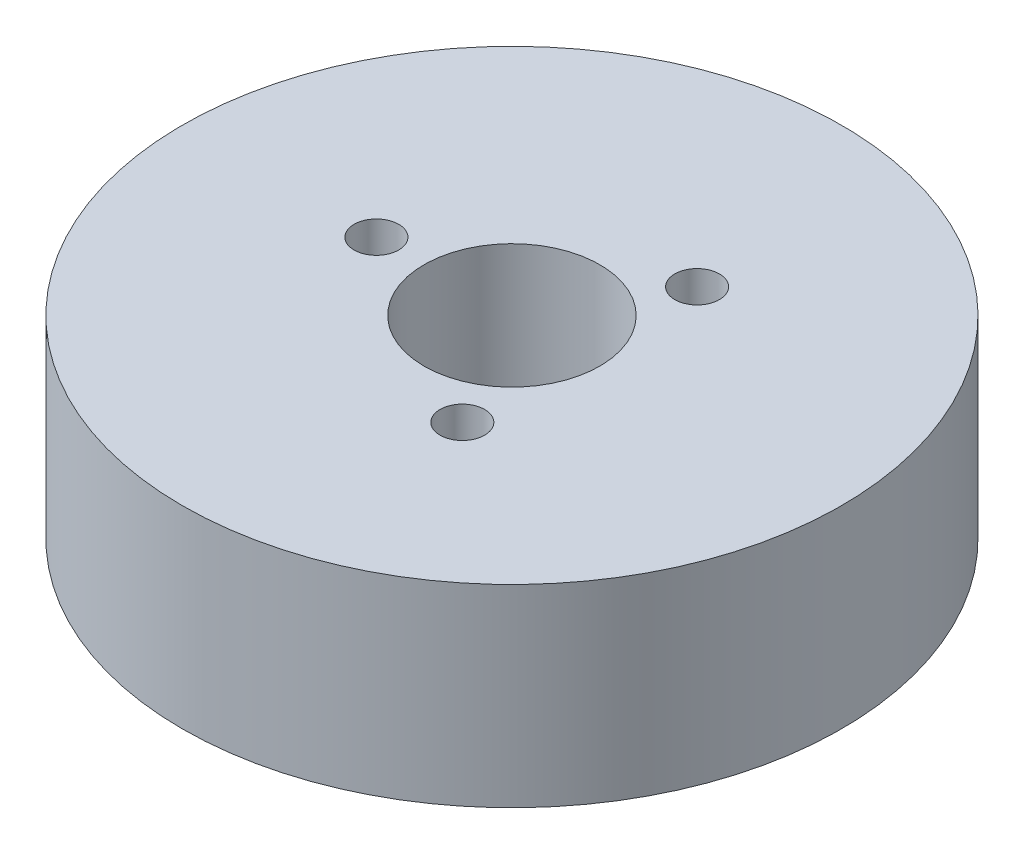
ISO-10303-21;
HEADER;
FILE_DESCRIPTION(('STEP AP214'),'2;1');
FILE_NAME('part.step','',(''),(''),'','','');
FILE_SCHEMA(('AUTOMOTIVE_DESIGN { 1 0 10303 214 1 1 1 1 }'));
ENDSEC;
DATA;
#1=APPLICATION_CONTEXT('core data for automotive mechanical design processes');
#2=APPLICATION_PROTOCOL_DEFINITION('international standard','automotive_design',2000,#1);
#3=PRODUCT_CONTEXT('',#1,'mechanical');
#4=PRODUCT('Part','Part','',(#3));
#5=PRODUCT_RELATED_PRODUCT_CATEGORY('part','',(#4));
#6=PRODUCT_DEFINITION_FORMATION('','',#4);
#7=PRODUCT_DEFINITION_CONTEXT('part definition',#1,'design');
#8=PRODUCT_DEFINITION('design','',#6,#7);
#9=PRODUCT_DEFINITION_SHAPE('','',#8);
#10=(LENGTH_UNIT() NAMED_UNIT(*) SI_UNIT(.MILLI.,.METRE.));
#11=(NAMED_UNIT(*) PLANE_ANGLE_UNIT() SI_UNIT($,.RADIAN.));
#12=(NAMED_UNIT(*) SI_UNIT($,.STERADIAN.) SOLID_ANGLE_UNIT());
#13=UNCERTAINTY_MEASURE_WITH_UNIT(LENGTH_MEASURE(1.E-05),#10,'distance_accuracy_value','');
#14=(GEOMETRIC_REPRESENTATION_CONTEXT(3) GLOBAL_UNCERTAINTY_ASSIGNED_CONTEXT((#13)) GLOBAL_UNIT_ASSIGNED_CONTEXT((#10,
#11,#12)) REPRESENTATION_CONTEXT('',''));
#15=CARTESIAN_POINT('',(0.,0.,0.));
#16=DIRECTION('',(0.,0.,1.));
#17=DIRECTION('',(1.,0.,0.));
#18=AXIS2_PLACEMENT_3D('',#15,#16,#17);
#19=CARTESIAN_POINT('',(0.,22.,0.));
#20=DIRECTION('',(0.,-1.,0.));
#21=DIRECTION('',(0.,0.,-1.));
#22=AXIS2_PLACEMENT_3D('',#19,#20,#21);
#23=CYLINDRICAL_SURFACE('',#22,37.5);
#24=CARTESIAN_POINT('',(0.,22.,0.));
#25=DIRECTION('',(0.,1.,0.));
#26=DIRECTION('',(0.,0.,1.));
#27=AXIS2_PLACEMENT_3D('',#24,#25,#26);
#28=CIRCLE('',#27,37.5);
#29=CARTESIAN_POINT('',(0.,22.,37.5));
#30=VERTEX_POINT('',#29);
#31=EDGE_CURVE('E10',#30,#30,#28,.T.);
#32=ORIENTED_EDGE('',*,*,#31,.F.);
#33=EDGE_LOOP('',(#32));
#34=FACE_BOUND('',#33,.T.);
#35=CARTESIAN_POINT('',(0.,0.,0.));
#36=DIRECTION('',(0.,1.,0.));
#37=DIRECTION('',(0.,0.,1.));
#38=AXIS2_PLACEMENT_3D('',#35,#36,#37);
#39=CIRCLE('',#38,37.5);
#40=CARTESIAN_POINT('',(0.,0.,37.5));
#41=VERTEX_POINT('',#40);
#42=EDGE_CURVE('E37',#41,#41,#39,.T.);
#43=ORIENTED_EDGE('',*,*,#42,.T.);
#44=EDGE_LOOP('',(#43));
#45=FACE_BOUND('',#44,.T.);
#46=ADVANCED_FACE('F40',(#34,#45),#23,.T.);
#47=CARTESIAN_POINT('',(0.,22.,0.));
#48=DIRECTION('',(0.,1.,0.));
#49=DIRECTION('',(0.,0.,1.));
#50=AXIS2_PLACEMENT_3D('',#47,#48,#49);
#51=PLANE('',#50);
#52=CARTESIAN_POINT('',(7.71119194266584,22.,13.3561762316128));
#53=DIRECTION('',(0.,1.,0.));
#54=DIRECTION('',(0.866025403784436,0.,-0.500000000000004));
#55=AXIS2_PLACEMENT_3D('',#52,#53,#54);
#56=CIRCLE('',#55,2.53900812981984);
#57=CARTESIAN_POINT('',(9.91003748350503,22.,12.0866721667029));
#58=VERTEX_POINT('',#57);
#59=EDGE_CURVE('E70',#58,#58,#56,.T.);
#60=ORIENTED_EDGE('',*,*,#59,.F.);
#61=EDGE_LOOP('',(#60));
#62=FACE_BOUND('',#61,.T.);
#63=CARTESIAN_POINT('',(7.71119194266565,22.,-13.356176231613));
#64=DIRECTION('',(0.,1.,0.));
#65=DIRECTION('',(-0.866025403784443,0.,-0.499999999999992));
#66=AXIS2_PLACEMENT_3D('',#63,#64,#65);
#67=CIRCLE('',#66,2.53900812981984);
#68=CARTESIAN_POINT('',(5.51234640182644,22.,-14.6256802965228));
#69=VERTEX_POINT('',#68);
#70=EDGE_CURVE('E61',#69,#69,#67,.T.);
#71=ORIENTED_EDGE('',*,*,#70,.F.);
#72=EDGE_LOOP('',(#71));
#73=FACE_BOUND('',#72,.T.);
#74=CARTESIAN_POINT('',(-15.4223838853316,22.,0.));
#75=DIRECTION('',(0.,1.,0.));
#76=DIRECTION('',(0.,0.,1.));
#77=AXIS2_PLACEMENT_3D('',#74,#75,#76);
#78=CIRCLE('',#77,2.53900812981984);
#79=CARTESIAN_POINT('',(-15.4223838853316,22.,2.53900812981984));
#80=VERTEX_POINT('',#79);
#81=EDGE_CURVE('E54',#80,#80,#78,.T.);
#82=ORIENTED_EDGE('',*,*,#81,.F.);
#83=EDGE_LOOP('',(#82));
#84=FACE_BOUND('',#83,.T.);
#85=CARTESIAN_POINT('',(0.,22.,0.));
#86=DIRECTION('',(0.,1.,0.));
#87=DIRECTION('',(0.,0.,1.));
#88=AXIS2_PLACEMENT_3D('',#85,#86,#87);
#89=CIRCLE('',#88,10.);
#90=CARTESIAN_POINT('',(0.,22.,10.));
#91=VERTEX_POINT('',#90);
#92=EDGE_CURVE('E50',#91,#91,#89,.T.);
#93=ORIENTED_EDGE('',*,*,#92,.F.);
#94=EDGE_LOOP('',(#93));
#95=FACE_BOUND('',#94,.T.);
#96=ORIENTED_EDGE('',*,*,#31,.T.);
#97=EDGE_LOOP('',(#96));
#98=FACE_BOUND('',#97,.T.);
#99=ADVANCED_FACE('F85',(#62,#73,#84,#95,#98),#51,.T.);
#100=CARTESIAN_POINT('',(0.,0.,0.));
#101=DIRECTION('',(0.,1.,0.));
#102=DIRECTION('',(0.,0.,1.));
#103=AXIS2_PLACEMENT_3D('',#100,#101,#102);
#104=PLANE('',#103);
#105=CARTESIAN_POINT('',(0.,0.,0.));
#106=DIRECTION('',(0.,1.,0.));
#107=DIRECTION('',(0.,0.,1.));
#108=AXIS2_PLACEMENT_3D('',#105,#106,#107);
#109=CIRCLE('',#108,10.);
#110=CARTESIAN_POINT('',(0.,0.,10.));
#111=VERTEX_POINT('',#110);
#112=EDGE_CURVE('E47',#111,#111,#109,.T.);
#113=ORIENTED_EDGE('',*,*,#112,.T.);
#114=EDGE_LOOP('',(#113));
#115=FACE_BOUND('',#114,.T.);
#116=ORIENTED_EDGE('',*,*,#42,.F.);
#117=EDGE_LOOP('',(#116));
#118=FACE_BOUND('',#117,.T.);
#119=ADVANCED_FACE('F84',(#115,#118),#104,.F.);
#120=CARTESIAN_POINT('',(0.,22.,0.));
#121=DIRECTION('',(0.,-1.,0.));
#122=DIRECTION('',(0.,0.,-1.));
#123=AXIS2_PLACEMENT_3D('',#120,#121,#122);
#124=CYLINDRICAL_SURFACE('',#123,10.);
#125=ORIENTED_EDGE('',*,*,#92,.T.);
#126=EDGE_LOOP('',(#125));
#127=FACE_BOUND('',#126,.T.);
#128=ORIENTED_EDGE('',*,*,#112,.F.);
#129=EDGE_LOOP('',(#128));
#130=FACE_BOUND('',#129,.T.);
#131=ADVANCED_FACE('F91',(#127,#130),#124,.F.);
#132=CARTESIAN_POINT('',(-15.4223838853316,3.02066008994741,0.));
#133=DIRECTION('',(0.,1.,0.));
#134=DIRECTION('',(0.,0.,1.));
#135=AXIS2_PLACEMENT_3D('',#132,#133,#134);
#136=CYLINDRICAL_SURFACE('',#135,2.53900812981984);
#137=CARTESIAN_POINT('',(-15.4223838853316,3.02066008994741,0.));
#138=DIRECTION('',(0.,1.,0.));
#139=DIRECTION('',(0.,0.,1.));
#140=AXIS2_PLACEMENT_3D('',#137,#138,#139);
#141=CIRCLE('',#140,2.53900812981984);
#142=CARTESIAN_POINT('',(-15.4223838853316,3.02066008994741,2.53900812981984));
#143=VERTEX_POINT('',#142);
#144=EDGE_CURVE('E55',#143,#143,#141,.T.);
#145=ORIENTED_EDGE('',*,*,#144,.F.);
#146=EDGE_LOOP('',(#145));
#147=FACE_BOUND('',#146,.T.);
#148=ORIENTED_EDGE('',*,*,#81,.T.);
#149=EDGE_LOOP('',(#148));
#150=FACE_BOUND('',#149,.T.);
#151=ADVANCED_FACE('F96',(#147,#150),#136,.F.);
#152=CARTESIAN_POINT('',(-15.4223838853316,3.02066008994741,0.));
#153=DIRECTION('',(0.,1.,0.));
#154=DIRECTION('',(0.,0.,1.));
#155=AXIS2_PLACEMENT_3D('',#152,#153,#154);
#156=PLANE('',#155);
#157=ORIENTED_EDGE('',*,*,#144,.T.);
#158=EDGE_LOOP('',(#157));
#159=FACE_BOUND('',#158,.T.);
#160=ADVANCED_FACE('F127',(#159),#156,.T.);
#161=CARTESIAN_POINT('',(7.71119194266565,3.02066008994741,-13.356176231613));
#162=DIRECTION('',(0.,1.,0.));
#163=DIRECTION('',(0.,0.,1.));
#164=AXIS2_PLACEMENT_3D('',#161,#162,#163);
#165=CYLINDRICAL_SURFACE('',#164,2.53900812981984);
#166=CARTESIAN_POINT('',(7.71119194266565,3.02066008994741,-13.356176231613));
#167=DIRECTION('',(0.,1.,0.));
#168=DIRECTION('',(-0.866025403784443,0.,-0.499999999999992));
#169=AXIS2_PLACEMENT_3D('',#166,#167,#168);
#170=CIRCLE('',#169,2.53900812981984);
#171=CARTESIAN_POINT('',(5.51234640182644,3.02066008994741,-14.6256802965228));
#172=VERTEX_POINT('',#171);
#173=EDGE_CURVE('E63',#172,#172,#170,.T.);
#174=ORIENTED_EDGE('',*,*,#173,.F.);
#175=EDGE_LOOP('',(#174));
#176=FACE_BOUND('',#175,.T.);
#177=ORIENTED_EDGE('',*,*,#70,.T.);
#178=EDGE_LOOP('',(#177));
#179=FACE_BOUND('',#178,.T.);
#180=ADVANCED_FACE('F133',(#176,#179),#165,.F.);
#181=CARTESIAN_POINT('',(7.71119194266565,3.02066008994741,-13.356176231613));
#182=DIRECTION('',(0.,1.,0.));
#183=DIRECTION('',(-0.866025403784443,0.,-0.499999999999992));
#184=AXIS2_PLACEMENT_3D('',#181,#182,#183);
#185=PLANE('',#184);
#186=ORIENTED_EDGE('',*,*,#173,.T.);
#187=EDGE_LOOP('',(#186));
#188=FACE_BOUND('',#187,.T.);
#189=ADVANCED_FACE('F77',(#188),#185,.T.);
#190=CARTESIAN_POINT('',(7.71119194266584,3.02066008994741,13.3561762316128));
#191=DIRECTION('',(0.,1.,0.));
#192=DIRECTION('',(0.,0.,1.));
#193=AXIS2_PLACEMENT_3D('',#190,#191,#192);
#194=CYLINDRICAL_SURFACE('',#193,2.53900812981984);
#195=CARTESIAN_POINT('',(7.71119194266584,3.02066008994741,13.3561762316128));
#196=DIRECTION('',(0.,1.,0.));
#197=DIRECTION('',(0.866025403784436,0.,-0.500000000000004));
#198=AXIS2_PLACEMENT_3D('',#195,#196,#197);
#199=CIRCLE('',#198,2.53900812981984);
#200=CARTESIAN_POINT('',(9.91003748350503,3.02066008994741,12.0866721667029));
#201=VERTEX_POINT('',#200);
#202=EDGE_CURVE('E59',#201,#201,#199,.T.);
#203=ORIENTED_EDGE('',*,*,#202,.F.);
#204=EDGE_LOOP('',(#203));
#205=FACE_BOUND('',#204,.T.);
#206=ORIENTED_EDGE('',*,*,#59,.T.);
#207=EDGE_LOOP('',(#206));
#208=FACE_BOUND('',#207,.T.);
#209=ADVANCED_FACE('F73',(#205,#208),#194,.F.);
#210=CARTESIAN_POINT('',(7.71119194266584,3.02066008994741,13.3561762316128));
#211=DIRECTION('',(0.,1.,0.));
#212=DIRECTION('',(0.866025403784436,0.,-0.500000000000004));
#213=AXIS2_PLACEMENT_3D('',#210,#211,#212);
#214=PLANE('',#213);
#215=ORIENTED_EDGE('',*,*,#202,.T.);
#216=EDGE_LOOP('',(#215));
#217=FACE_BOUND('',#216,.T.);
#218=ADVANCED_FACE('F71',(#217),#214,.T.);
#219=CLOSED_SHELL('',(#46,#99,#119,#131,#151,#160,#180,#189,#209,#218));
#220=MANIFOLD_SOLID_BREP('B2',#219);
#221=ADVANCED_BREP_SHAPE_REPRESENTATION('',(#18,#220),#14);
#222=SHAPE_DEFINITION_REPRESENTATION(#9,#221);
ENDSEC;
END-ISO-10303-21;
